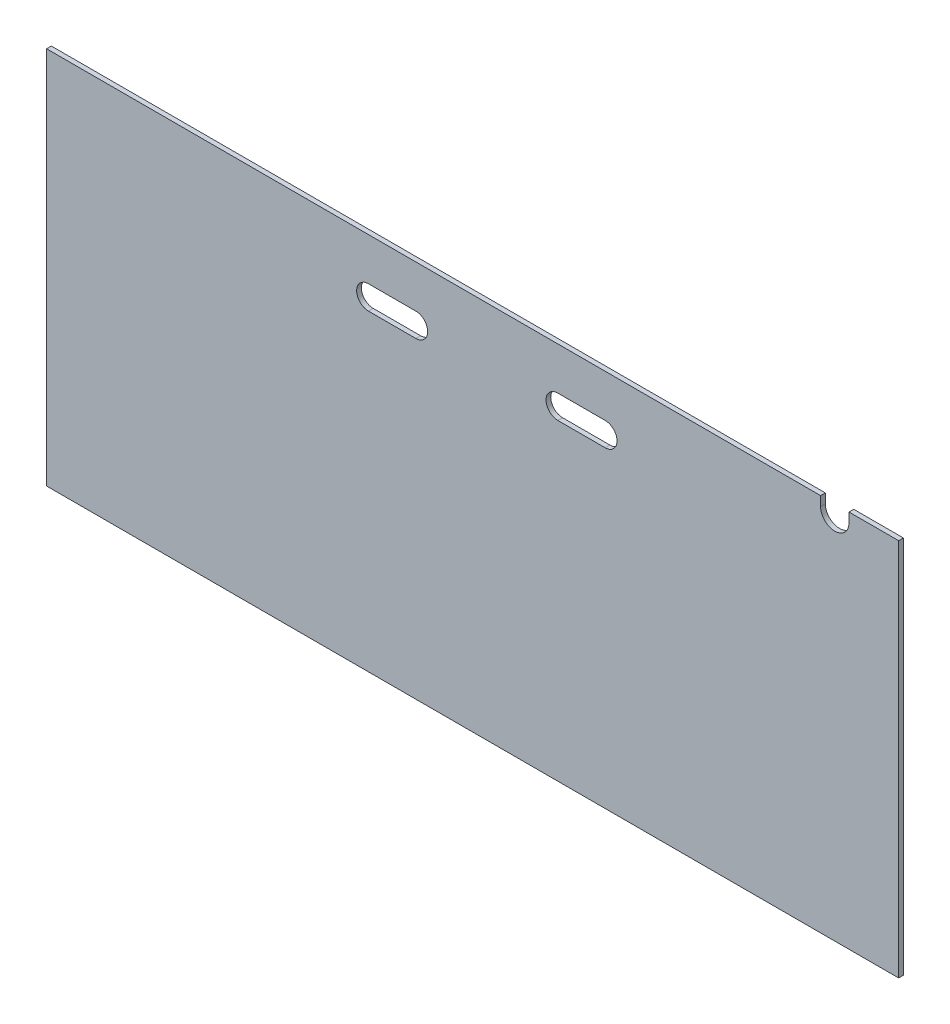
ISO-10303-21;
HEADER;
FILE_DESCRIPTION(('STEP AP214'),'2;1');
FILE_NAME('part.step','',(''),(''),'','','');
FILE_SCHEMA(('AUTOMOTIVE_DESIGN { 1 0 10303 214 1 1 1 1 }'));
ENDSEC;
DATA;
#1=APPLICATION_CONTEXT('core data for automotive mechanical design processes');
#2=APPLICATION_PROTOCOL_DEFINITION('international standard','automotive_design',2000,#1);
#3=PRODUCT_CONTEXT('',#1,'mechanical');
#4=PRODUCT('Part','Part','',(#3));
#5=PRODUCT_RELATED_PRODUCT_CATEGORY('part','',(#4));
#6=PRODUCT_DEFINITION_FORMATION('','',#4);
#7=PRODUCT_DEFINITION_CONTEXT('part definition',#1,'design');
#8=PRODUCT_DEFINITION('design','',#6,#7);
#9=PRODUCT_DEFINITION_SHAPE('','',#8);
#10=(LENGTH_UNIT() NAMED_UNIT(*) SI_UNIT(.MILLI.,.METRE.));
#11=(NAMED_UNIT(*) PLANE_ANGLE_UNIT() SI_UNIT($,.RADIAN.));
#12=(NAMED_UNIT(*) SI_UNIT($,.STERADIAN.) SOLID_ANGLE_UNIT());
#13=UNCERTAINTY_MEASURE_WITH_UNIT(LENGTH_MEASURE(1.E-05),#10,'distance_accuracy_value','');
#14=(GEOMETRIC_REPRESENTATION_CONTEXT(3) GLOBAL_UNCERTAINTY_ASSIGNED_CONTEXT((#13)) GLOBAL_UNIT_ASSIGNED_CONTEXT((#10,
#11,#12)) REPRESENTATION_CONTEXT('',''));
#15=CARTESIAN_POINT('',(0.,0.,0.));
#16=DIRECTION('',(0.,0.,1.));
#17=DIRECTION('',(1.,0.,0.));
#18=AXIS2_PLACEMENT_3D('',#15,#16,#17);
#19=CARTESIAN_POINT('',(0.,508.,6.35));
#20=DIRECTION('',(0.,-1.,0.));
#21=DIRECTION('',(0.,0.,-1.));
#22=AXIS2_PLACEMENT_3D('',#19,#20,#21);
#23=PLANE('',#22);
#24=DIRECTION('',(-1.,0.,0.));
#25=VECTOR('',#24,1.);
#26=CARTESIAN_POINT('',(0.,508.,6.35));
#27=LINE('',#26,#25);
#28=CARTESIAN_POINT('',(1038.225,508.,6.35));
#29=VERTEX_POINT('',#28);
#30=CARTESIAN_POINT('',(0.,508.,6.35));
#31=VERTEX_POINT('',#30);
#32=EDGE_CURVE('E253',#29,#31,#27,.T.);
#33=ORIENTED_EDGE('',*,*,#32,.F.);
#34=DIRECTION('',(0.,0.,1.));
#35=VECTOR('',#34,1.);
#36=CARTESIAN_POINT('',(1038.225,508.,0.));
#37=LINE('',#36,#35);
#38=CARTESIAN_POINT('',(1038.225,508.,0.));
#39=VERTEX_POINT('',#38);
#40=EDGE_CURVE('E176',#39,#29,#37,.T.);
#41=ORIENTED_EDGE('',*,*,#40,.F.);
#42=DIRECTION('',(-1.,0.,0.));
#43=VECTOR('',#42,1.);
#44=CARTESIAN_POINT('',(0.,508.,0.));
#45=LINE('',#44,#43);
#46=CARTESIAN_POINT('',(0.,508.,0.));
#47=VERTEX_POINT('',#46);
#48=EDGE_CURVE('E167',#39,#47,#45,.T.);
#49=ORIENTED_EDGE('',*,*,#48,.T.);
#50=DIRECTION('',(0.,0.,-1.));
#51=VECTOR('',#50,1.);
#52=CARTESIAN_POINT('',(0.,508.,6.35));
#53=LINE('',#52,#51);
#54=EDGE_CURVE('E257',#31,#47,#53,.T.);
#55=ORIENTED_EDGE('',*,*,#54,.F.);
#56=EDGE_LOOP('',(#33,#41,#49,#55));
#57=FACE_BOUND('',#56,.T.);
#58=ADVANCED_FACE('F33',(#57),#23,.F.);
#59=CARTESIAN_POINT('',(0.,0.,6.35));
#60=DIRECTION('',(1.,0.,0.));
#61=DIRECTION('',(0.,0.,-1.));
#62=AXIS2_PLACEMENT_3D('',#59,#60,#61);
#63=PLANE('',#62);
#64=DIRECTION('',(0.,-1.,0.));
#65=VECTOR('',#64,1.);
#66=CARTESIAN_POINT('',(0.,0.,0.));
#67=LINE('',#66,#65);
#68=CARTESIAN_POINT('',(0.,0.,0.));
#69=VERTEX_POINT('',#68);
#70=EDGE_CURVE('E209',#47,#69,#67,.T.);
#71=ORIENTED_EDGE('',*,*,#70,.T.);
#72=DIRECTION('',(0.,0.,-1.));
#73=VECTOR('',#72,1.);
#74=CARTESIAN_POINT('',(0.,0.,6.35));
#75=LINE('',#74,#73);
#76=CARTESIAN_POINT('',(0.,0.,6.35));
#77=VERTEX_POINT('',#76);
#78=EDGE_CURVE('E11',#77,#69,#75,.T.);
#79=ORIENTED_EDGE('',*,*,#78,.F.);
#80=DIRECTION('',(0.,-1.,0.));
#81=VECTOR('',#80,1.);
#82=CARTESIAN_POINT('',(0.,0.,6.35));
#83=LINE('',#82,#81);
#84=EDGE_CURVE('E245',#31,#77,#83,.T.);
#85=ORIENTED_EDGE('',*,*,#84,.F.);
#86=ORIENTED_EDGE('',*,*,#54,.T.);
#87=EDGE_LOOP('',(#71,#79,#85,#86));
#88=FACE_BOUND('',#87,.T.);
#89=ADVANCED_FACE('F35',(#88),#63,.F.);
#90=CARTESIAN_POINT('',(0.,0.,6.35));
#91=DIRECTION('',(0.,1.,0.));
#92=DIRECTION('',(0.,0.,1.));
#93=AXIS2_PLACEMENT_3D('',#90,#91,#92);
#94=PLANE('',#93);
#95=DIRECTION('',(1.,0.,0.));
#96=VECTOR('',#95,1.);
#97=CARTESIAN_POINT('',(0.,0.,0.));
#98=LINE('',#97,#96);
#99=CARTESIAN_POINT('',(1143.,0.,0.));
#100=VERTEX_POINT('',#99);
#101=EDGE_CURVE('E260',#69,#100,#98,.T.);
#102=ORIENTED_EDGE('',*,*,#101,.T.);
#103=DIRECTION('',(0.,0.,-1.));
#104=VECTOR('',#103,1.);
#105=CARTESIAN_POINT('',(1143.,0.,6.35));
#106=LINE('',#105,#104);
#107=CARTESIAN_POINT('',(1143.,0.,6.35));
#108=VERTEX_POINT('',#107);
#109=EDGE_CURVE('E41',#108,#100,#106,.T.);
#110=ORIENTED_EDGE('',*,*,#109,.F.);
#111=DIRECTION('',(1.,0.,0.));
#112=VECTOR('',#111,1.);
#113=CARTESIAN_POINT('',(0.,0.,6.35));
#114=LINE('',#113,#112);
#115=EDGE_CURVE('E248',#77,#108,#114,.T.);
#116=ORIENTED_EDGE('',*,*,#115,.F.);
#117=ORIENTED_EDGE('',*,*,#78,.T.);
#118=EDGE_LOOP('',(#102,#110,#116,#117));
#119=FACE_BOUND('',#118,.T.);
#120=ADVANCED_FACE('F287',(#119),#94,.F.);
#121=CARTESIAN_POINT('',(1143.,0.,6.35));
#122=DIRECTION('',(-1.,0.,0.));
#123=DIRECTION('',(0.,0.,1.));
#124=AXIS2_PLACEMENT_3D('',#121,#122,#123);
#125=PLANE('',#124);
#126=DIRECTION('',(0.,1.,0.));
#127=VECTOR('',#126,1.);
#128=CARTESIAN_POINT('',(1143.,0.,0.));
#129=LINE('',#128,#127);
#130=CARTESIAN_POINT('',(1143.,508.,0.));
#131=VERTEX_POINT('',#130);
#132=EDGE_CURVE('E262',#100,#131,#129,.T.);
#133=ORIENTED_EDGE('',*,*,#132,.T.);
#134=DIRECTION('',(0.,0.,-1.));
#135=VECTOR('',#134,1.);
#136=CARTESIAN_POINT('',(1143.,508.,6.35));
#137=LINE('',#136,#135);
#138=CARTESIAN_POINT('',(1143.,508.,6.35));
#139=VERTEX_POINT('',#138);
#140=EDGE_CURVE('E268',#139,#131,#137,.T.);
#141=ORIENTED_EDGE('',*,*,#140,.F.);
#142=DIRECTION('',(0.,1.,0.));
#143=VECTOR('',#142,1.);
#144=CARTESIAN_POINT('',(1143.,0.,6.35));
#145=LINE('',#144,#143);
#146=EDGE_CURVE('E251',#108,#139,#145,.T.);
#147=ORIENTED_EDGE('',*,*,#146,.F.);
#148=ORIENTED_EDGE('',*,*,#109,.T.);
#149=EDGE_LOOP('',(#133,#141,#147,#148));
#150=FACE_BOUND('',#149,.T.);
#151=ADVANCED_FACE('F275',(#150),#125,.F.);
#152=CARTESIAN_POINT('',(1076.325,508.,0.));
#153=VERTEX_POINT('',#152);
#154=EDGE_CURVE('E249',#131,#153,#45,.T.);
#155=ORIENTED_EDGE('',*,*,#154,.T.);
#156=DIRECTION('',(0.,0.,1.));
#157=VECTOR('',#156,1.);
#158=CARTESIAN_POINT('',(1076.325,508.,0.));
#159=LINE('',#158,#157);
#160=CARTESIAN_POINT('',(1076.325,508.,6.35));
#161=VERTEX_POINT('',#160);
#162=EDGE_CURVE('E179',#153,#161,#159,.T.);
#163=ORIENTED_EDGE('',*,*,#162,.T.);
#164=EDGE_CURVE('E254',#139,#161,#27,.T.);
#165=ORIENTED_EDGE('',*,*,#164,.F.);
#166=ORIENTED_EDGE('',*,*,#140,.T.);
#167=EDGE_LOOP('',(#155,#163,#165,#166));
#168=FACE_BOUND('',#167,.T.);
#169=ADVANCED_FACE('F280',(#168),#23,.F.);
#170=CARTESIAN_POINT('',(0.,0.,6.35));
#171=DIRECTION('',(0.,0.,-1.));
#172=DIRECTION('',(-1.,0.,0.));
#173=AXIS2_PLACEMENT_3D('',#170,#171,#172);
#174=PLANE('',#173);
#175=DIRECTION('',(1.,0.,0.));
#176=VECTOR('',#175,1.);
#177=CARTESIAN_POINT('',(431.8,419.1,6.35));
#178=LINE('',#177,#176);
#179=CARTESIAN_POINT('',(431.8,419.1,6.35));
#180=VERTEX_POINT('',#179);
#181=CARTESIAN_POINT('',(495.3,419.1,6.35));
#182=VERTEX_POINT('',#181);
#183=EDGE_CURVE('E198',#180,#182,#178,.T.);
#184=ORIENTED_EDGE('',*,*,#183,.F.);
#185=CARTESIAN_POINT('',(431.8,434.975,6.35));
#186=DIRECTION('',(0.,0.,1.));
#187=DIRECTION('',(1.,0.,0.));
#188=AXIS2_PLACEMENT_3D('',#185,#186,#187);
#189=CIRCLE('',#188,15.875);
#190=CARTESIAN_POINT('',(431.8,450.85,6.35));
#191=VERTEX_POINT('',#190);
#192=EDGE_CURVE('E56',#191,#180,#189,.T.);
#193=ORIENTED_EDGE('',*,*,#192,.F.);
#194=DIRECTION('',(-1.,0.,0.));
#195=VECTOR('',#194,1.);
#196=CARTESIAN_POINT('',(431.8,450.85,6.35));
#197=LINE('',#196,#195);
#198=CARTESIAN_POINT('',(495.3,450.85,6.35));
#199=VERTEX_POINT('',#198);
#200=EDGE_CURVE('E187',#199,#191,#197,.T.);
#201=ORIENTED_EDGE('',*,*,#200,.F.);
#202=CARTESIAN_POINT('',(495.3,434.975,6.35));
#203=DIRECTION('',(0.,0.,1.));
#204=DIRECTION('',(1.,0.,0.));
#205=AXIS2_PLACEMENT_3D('',#202,#203,#204);
#206=CIRCLE('',#205,15.875);
#207=EDGE_CURVE('E202',#182,#199,#206,.T.);
#208=ORIENTED_EDGE('',*,*,#207,.F.);
#209=EDGE_LOOP('',(#184,#193,#201,#208));
#210=FACE_BOUND('',#209,.T.);
#211=DIRECTION('',(1.,0.,0.));
#212=VECTOR('',#211,1.);
#213=CARTESIAN_POINT('',(685.8,419.1,6.35));
#214=LINE('',#213,#212);
#215=CARTESIAN_POINT('',(685.8,419.1,6.35));
#216=VERTEX_POINT('',#215);
#217=CARTESIAN_POINT('',(749.3,419.1,6.35));
#218=VERTEX_POINT('',#217);
#219=EDGE_CURVE('E230',#216,#218,#214,.T.);
#220=ORIENTED_EDGE('',*,*,#219,.F.);
#221=CARTESIAN_POINT('',(685.8,434.975,6.35));
#222=DIRECTION('',(0.,0.,1.));
#223=DIRECTION('',(1.,0.,0.));
#224=AXIS2_PLACEMENT_3D('',#221,#222,#223);
#225=CIRCLE('',#224,15.875);
#226=CARTESIAN_POINT('',(685.8,450.85,6.35));
#227=VERTEX_POINT('',#226);
#228=EDGE_CURVE('E178',#227,#216,#225,.T.);
#229=ORIENTED_EDGE('',*,*,#228,.F.);
#230=DIRECTION('',(-1.,0.,0.));
#231=VECTOR('',#230,1.);
#232=CARTESIAN_POINT('',(685.8,450.85,6.35));
#233=LINE('',#232,#231);
#234=CARTESIAN_POINT('',(749.3,450.85,6.35));
#235=VERTEX_POINT('',#234);
#236=EDGE_CURVE('E219',#235,#227,#233,.T.);
#237=ORIENTED_EDGE('',*,*,#236,.F.);
#238=CARTESIAN_POINT('',(749.3,434.975,6.35));
#239=DIRECTION('',(0.,0.,1.));
#240=DIRECTION('',(1.,0.,0.));
#241=AXIS2_PLACEMENT_3D('',#238,#239,#240);
#242=CIRCLE('',#241,15.875);
#243=EDGE_CURVE('E233',#218,#235,#242,.T.);
#244=ORIENTED_EDGE('',*,*,#243,.F.);
#245=EDGE_LOOP('',(#220,#229,#237,#244));
#246=FACE_BOUND('',#245,.T.);
#247=CARTESIAN_POINT('',(1057.275,495.3,6.35));
#248=DIRECTION('',(0.,0.,1.));
#249=DIRECTION('',(-1.,0.,0.));
#250=AXIS2_PLACEMENT_3D('',#247,#248,#249);
#251=CIRCLE('',#250,19.05);
#252=CARTESIAN_POINT('',(1038.225,495.3,6.35));
#253=VERTEX_POINT('',#252);
#254=CARTESIAN_POINT('',(1076.325,495.3,6.35));
#255=VERTEX_POINT('',#254);
#256=EDGE_CURVE('E170',#253,#255,#251,.T.);
#257=ORIENTED_EDGE('',*,*,#256,.F.);
#258=DIRECTION('',(0.,-1.,0.));
#259=VECTOR('',#258,1.);
#260=CARTESIAN_POINT('',(1038.225,508.,6.35));
#261=LINE('',#260,#259);
#262=EDGE_CURVE('E152',#29,#253,#261,.T.);
#263=ORIENTED_EDGE('',*,*,#262,.F.);
#264=ORIENTED_EDGE('',*,*,#32,.T.);
#265=ORIENTED_EDGE('',*,*,#84,.T.);
#266=ORIENTED_EDGE('',*,*,#115,.T.);
#267=ORIENTED_EDGE('',*,*,#146,.T.);
#268=ORIENTED_EDGE('',*,*,#164,.T.);
#269=DIRECTION('',(0.,1.,0.));
#270=VECTOR('',#269,1.);
#271=CARTESIAN_POINT('',(1076.325,508.,6.35));
#272=LINE('',#271,#270);
#273=EDGE_CURVE('E168',#255,#161,#272,.T.);
#274=ORIENTED_EDGE('',*,*,#273,.F.);
#275=EDGE_LOOP('',(#257,#263,#264,#265,#266,#267,#268,#274));
#276=FACE_BOUND('',#275,.T.);
#277=ADVANCED_FACE('F284',(#210,#246,#276),#174,.F.);
#278=CARTESIAN_POINT('',(0.,0.,0.));
#279=DIRECTION('',(0.,0.,-1.));
#280=DIRECTION('',(-1.,0.,0.));
#281=AXIS2_PLACEMENT_3D('',#278,#279,#280);
#282=PLANE('',#281);
#283=DIRECTION('',(0.,-1.,0.));
#284=VECTOR('',#283,1.);
#285=CARTESIAN_POINT('',(1038.225,508.,0.));
#286=LINE('',#285,#284);
#287=CARTESIAN_POINT('',(1038.225,495.3,0.));
#288=VERTEX_POINT('',#287);
#289=EDGE_CURVE('E149',#39,#288,#286,.T.);
#290=ORIENTED_EDGE('',*,*,#289,.T.);
#291=CARTESIAN_POINT('',(1057.275,495.3,0.));
#292=DIRECTION('',(0.,0.,1.));
#293=DIRECTION('',(-1.,0.,0.));
#294=AXIS2_PLACEMENT_3D('',#291,#292,#293);
#295=CIRCLE('',#294,19.05);
#296=CARTESIAN_POINT('',(1076.325,495.3,0.));
#297=VERTEX_POINT('',#296);
#298=EDGE_CURVE('E159',#288,#297,#295,.T.);
#299=ORIENTED_EDGE('',*,*,#298,.T.);
#300=DIRECTION('',(0.,1.,0.));
#301=VECTOR('',#300,1.);
#302=CARTESIAN_POINT('',(1076.325,508.,0.));
#303=LINE('',#302,#301);
#304=EDGE_CURVE('E48',#297,#153,#303,.T.);
#305=ORIENTED_EDGE('',*,*,#304,.T.);
#306=ORIENTED_EDGE('',*,*,#154,.F.);
#307=ORIENTED_EDGE('',*,*,#132,.F.);
#308=ORIENTED_EDGE('',*,*,#101,.F.);
#309=ORIENTED_EDGE('',*,*,#70,.F.);
#310=ORIENTED_EDGE('',*,*,#48,.F.);
#311=EDGE_LOOP('',(#290,#299,#305,#306,#307,#308,#309,#310));
#312=FACE_BOUND('',#311,.T.);
#313=CARTESIAN_POINT('',(431.8,434.975,0.));
#314=DIRECTION('',(0.,0.,1.));
#315=DIRECTION('',(1.,0.,0.));
#316=AXIS2_PLACEMENT_3D('',#313,#314,#315);
#317=CIRCLE('',#316,15.875);
#318=CARTESIAN_POINT('',(431.8,450.85,0.));
#319=VERTEX_POINT('',#318);
#320=CARTESIAN_POINT('',(431.8,419.1,0.));
#321=VERTEX_POINT('',#320);
#322=EDGE_CURVE('E183',#319,#321,#317,.T.);
#323=ORIENTED_EDGE('',*,*,#322,.T.);
#324=DIRECTION('',(1.,0.,0.));
#325=VECTOR('',#324,1.);
#326=CARTESIAN_POINT('',(431.8,419.1,0.));
#327=LINE('',#326,#325);
#328=CARTESIAN_POINT('',(495.3,419.1,0.));
#329=VERTEX_POINT('',#328);
#330=EDGE_CURVE('E186',#321,#329,#327,.T.);
#331=ORIENTED_EDGE('',*,*,#330,.T.);
#332=CARTESIAN_POINT('',(495.3,434.975,0.));
#333=DIRECTION('',(0.,0.,1.));
#334=DIRECTION('',(1.,0.,0.));
#335=AXIS2_PLACEMENT_3D('',#332,#333,#334);
#336=CIRCLE('',#335,15.875);
#337=CARTESIAN_POINT('',(495.3,450.85,0.));
#338=VERTEX_POINT('',#337);
#339=EDGE_CURVE('E190',#329,#338,#336,.T.);
#340=ORIENTED_EDGE('',*,*,#339,.T.);
#341=DIRECTION('',(-1.,0.,0.));
#342=VECTOR('',#341,1.);
#343=CARTESIAN_POINT('',(431.8,450.85,0.));
#344=LINE('',#343,#342);
#345=EDGE_CURVE('E193',#338,#319,#344,.T.);
#346=ORIENTED_EDGE('',*,*,#345,.T.);
#347=EDGE_LOOP('',(#323,#331,#340,#346));
#348=FACE_BOUND('',#347,.T.);
#349=CARTESIAN_POINT('',(685.8,434.975,0.));
#350=DIRECTION('',(0.,0.,1.));
#351=DIRECTION('',(1.,0.,0.));
#352=AXIS2_PLACEMENT_3D('',#349,#350,#351);
#353=CIRCLE('',#352,15.875);
#354=CARTESIAN_POINT('',(685.8,450.85,0.));
#355=VERTEX_POINT('',#354);
#356=CARTESIAN_POINT('',(685.8,419.1,0.));
#357=VERTEX_POINT('',#356);
#358=EDGE_CURVE('E215',#355,#357,#353,.T.);
#359=ORIENTED_EDGE('',*,*,#358,.T.);
#360=DIRECTION('',(1.,0.,0.));
#361=VECTOR('',#360,1.);
#362=CARTESIAN_POINT('',(685.8,419.1,0.));
#363=LINE('',#362,#361);
#364=CARTESIAN_POINT('',(749.3,419.1,0.));
#365=VERTEX_POINT('',#364);
#366=EDGE_CURVE('E218',#357,#365,#363,.T.);
#367=ORIENTED_EDGE('',*,*,#366,.T.);
#368=CARTESIAN_POINT('',(749.3,434.975,0.));
#369=DIRECTION('',(0.,0.,1.));
#370=DIRECTION('',(1.,0.,0.));
#371=AXIS2_PLACEMENT_3D('',#368,#369,#370);
#372=CIRCLE('',#371,15.875);
#373=CARTESIAN_POINT('',(749.3,450.85,0.));
#374=VERTEX_POINT('',#373);
#375=EDGE_CURVE('E222',#365,#374,#372,.T.);
#376=ORIENTED_EDGE('',*,*,#375,.T.);
#377=DIRECTION('',(-1.,0.,0.));
#378=VECTOR('',#377,1.);
#379=CARTESIAN_POINT('',(685.8,450.85,0.));
#380=LINE('',#379,#378);
#381=EDGE_CURVE('E225',#374,#355,#380,.T.);
#382=ORIENTED_EDGE('',*,*,#381,.T.);
#383=EDGE_LOOP('',(#359,#367,#376,#382));
#384=FACE_BOUND('',#383,.T.);
#385=ADVANCED_FACE('F164',(#312,#348,#384),#282,.T.);
#386=CARTESIAN_POINT('',(685.8,434.975,0.));
#387=DIRECTION('',(0.,0.,1.));
#388=DIRECTION('',(1.,0.,0.));
#389=AXIS2_PLACEMENT_3D('',#386,#387,#388);
#390=CYLINDRICAL_SURFACE('',#389,15.875);
#391=ORIENTED_EDGE('',*,*,#228,.T.);
#392=DIRECTION('',(0.,0.,1.));
#393=VECTOR('',#392,1.);
#394=CARTESIAN_POINT('',(685.8,419.1,0.));
#395=LINE('',#394,#393);
#396=EDGE_CURVE('E228',#357,#216,#395,.T.);
#397=ORIENTED_EDGE('',*,*,#396,.F.);
#398=ORIENTED_EDGE('',*,*,#358,.F.);
#399=DIRECTION('',(0.,0.,1.));
#400=VECTOR('',#399,1.);
#401=CARTESIAN_POINT('',(685.8,450.85,0.));
#402=LINE('',#401,#400);
#403=EDGE_CURVE('E199',#355,#227,#402,.T.);
#404=ORIENTED_EDGE('',*,*,#403,.T.);
#405=EDGE_LOOP('',(#391,#397,#398,#404));
#406=FACE_BOUND('',#405,.T.);
#407=ADVANCED_FACE('F341',(#406),#390,.F.);
#408=CARTESIAN_POINT('',(685.8,450.85,0.));
#409=DIRECTION('',(0.,1.,0.));
#410=DIRECTION('',(0.,0.,1.));
#411=AXIS2_PLACEMENT_3D('',#408,#409,#410);
#412=PLANE('',#411);
#413=ORIENTED_EDGE('',*,*,#236,.T.);
#414=ORIENTED_EDGE('',*,*,#403,.F.);
#415=ORIENTED_EDGE('',*,*,#381,.F.);
#416=DIRECTION('',(0.,0.,1.));
#417=VECTOR('',#416,1.);
#418=CARTESIAN_POINT('',(749.3,450.85,0.));
#419=LINE('',#418,#417);
#420=EDGE_CURVE('E239',#374,#235,#419,.T.);
#421=ORIENTED_EDGE('',*,*,#420,.T.);
#422=EDGE_LOOP('',(#413,#414,#415,#421));
#423=FACE_BOUND('',#422,.T.);
#424=ADVANCED_FACE('F348',(#423),#412,.F.);
#425=CARTESIAN_POINT('',(749.3,434.975,0.));
#426=DIRECTION('',(0.,0.,1.));
#427=DIRECTION('',(1.,0.,0.));
#428=AXIS2_PLACEMENT_3D('',#425,#426,#427);
#429=CYLINDRICAL_SURFACE('',#428,15.875);
#430=ORIENTED_EDGE('',*,*,#243,.T.);
#431=ORIENTED_EDGE('',*,*,#420,.F.);
#432=ORIENTED_EDGE('',*,*,#375,.F.);
#433=DIRECTION('',(0.,0.,1.));
#434=VECTOR('',#433,1.);
#435=CARTESIAN_POINT('',(749.3,419.1,0.));
#436=LINE('',#435,#434);
#437=EDGE_CURVE('E241',#365,#218,#436,.T.);
#438=ORIENTED_EDGE('',*,*,#437,.T.);
#439=EDGE_LOOP('',(#430,#431,#432,#438));
#440=FACE_BOUND('',#439,.T.);
#441=ADVANCED_FACE('F357',(#440),#429,.F.);
#442=CARTESIAN_POINT('',(685.8,419.1,0.));
#443=DIRECTION('',(0.,-1.,0.));
#444=DIRECTION('',(0.,0.,-1.));
#445=AXIS2_PLACEMENT_3D('',#442,#443,#444);
#446=PLANE('',#445);
#447=ORIENTED_EDGE('',*,*,#219,.T.);
#448=ORIENTED_EDGE('',*,*,#437,.F.);
#449=ORIENTED_EDGE('',*,*,#366,.F.);
#450=ORIENTED_EDGE('',*,*,#396,.T.);
#451=EDGE_LOOP('',(#447,#448,#449,#450));
#452=FACE_BOUND('',#451,.T.);
#453=ADVANCED_FACE('F366',(#452),#446,.F.);
#454=CARTESIAN_POINT('',(431.8,434.975,0.));
#455=DIRECTION('',(0.,0.,1.));
#456=DIRECTION('',(1.,0.,0.));
#457=AXIS2_PLACEMENT_3D('',#454,#455,#456);
#458=CYLINDRICAL_SURFACE('',#457,15.875);
#459=ORIENTED_EDGE('',*,*,#192,.T.);
#460=DIRECTION('',(0.,0.,1.));
#461=VECTOR('',#460,1.);
#462=CARTESIAN_POINT('',(431.8,419.1,0.));
#463=LINE('',#462,#461);
#464=EDGE_CURVE('E196',#321,#180,#463,.T.);
#465=ORIENTED_EDGE('',*,*,#464,.F.);
#466=ORIENTED_EDGE('',*,*,#322,.F.);
#467=DIRECTION('',(0.,0.,1.));
#468=VECTOR('',#467,1.);
#469=CARTESIAN_POINT('',(431.8,450.85,0.));
#470=LINE('',#469,#468);
#471=EDGE_CURVE('E207',#319,#191,#470,.T.);
#472=ORIENTED_EDGE('',*,*,#471,.T.);
#473=EDGE_LOOP('',(#459,#465,#466,#472));
#474=FACE_BOUND('',#473,.T.);
#475=ADVANCED_FACE('F375',(#474),#458,.F.);
#476=CARTESIAN_POINT('',(431.8,450.85,0.));
#477=DIRECTION('',(0.,1.,0.));
#478=DIRECTION('',(0.,0.,1.));
#479=AXIS2_PLACEMENT_3D('',#476,#477,#478);
#480=PLANE('',#479);
#481=ORIENTED_EDGE('',*,*,#200,.T.);
#482=ORIENTED_EDGE('',*,*,#471,.F.);
#483=ORIENTED_EDGE('',*,*,#345,.F.);
#484=DIRECTION('',(0.,0.,1.));
#485=VECTOR('',#484,1.);
#486=CARTESIAN_POINT('',(495.3,450.85,0.));
#487=LINE('',#486,#485);
#488=EDGE_CURVE('E210',#338,#199,#487,.T.);
#489=ORIENTED_EDGE('',*,*,#488,.T.);
#490=EDGE_LOOP('',(#481,#482,#483,#489));
#491=FACE_BOUND('',#490,.T.);
#492=ADVANCED_FACE('F384',(#491),#480,.F.);
#493=CARTESIAN_POINT('',(495.3,434.975,0.));
#494=DIRECTION('',(0.,0.,1.));
#495=DIRECTION('',(1.,0.,0.));
#496=AXIS2_PLACEMENT_3D('',#493,#494,#495);
#497=CYLINDRICAL_SURFACE('',#496,15.875);
#498=ORIENTED_EDGE('',*,*,#207,.T.);
#499=ORIENTED_EDGE('',*,*,#488,.F.);
#500=ORIENTED_EDGE('',*,*,#339,.F.);
#501=DIRECTION('',(0.,0.,1.));
#502=VECTOR('',#501,1.);
#503=CARTESIAN_POINT('',(495.3,419.1,0.));
#504=LINE('',#503,#502);
#505=EDGE_CURVE('E212',#329,#182,#504,.T.);
#506=ORIENTED_EDGE('',*,*,#505,.T.);
#507=EDGE_LOOP('',(#498,#499,#500,#506));
#508=FACE_BOUND('',#507,.T.);
#509=ADVANCED_FACE('F392',(#508),#497,.F.);
#510=CARTESIAN_POINT('',(431.8,419.1,0.));
#511=DIRECTION('',(0.,-1.,0.));
#512=DIRECTION('',(0.,0.,-1.));
#513=AXIS2_PLACEMENT_3D('',#510,#511,#512);
#514=PLANE('',#513);
#515=ORIENTED_EDGE('',*,*,#183,.T.);
#516=ORIENTED_EDGE('',*,*,#505,.F.);
#517=ORIENTED_EDGE('',*,*,#330,.F.);
#518=ORIENTED_EDGE('',*,*,#464,.T.);
#519=EDGE_LOOP('',(#515,#516,#517,#518));
#520=FACE_BOUND('',#519,.T.);
#521=ADVANCED_FACE('F401',(#520),#514,.F.);
#522=CARTESIAN_POINT('',(1038.225,508.,0.));
#523=DIRECTION('',(-1.,0.,0.));
#524=DIRECTION('',(0.,0.,1.));
#525=AXIS2_PLACEMENT_3D('',#522,#523,#524);
#526=PLANE('',#525);
#527=ORIENTED_EDGE('',*,*,#262,.T.);
#528=DIRECTION('',(0.,0.,1.));
#529=VECTOR('',#528,1.);
#530=CARTESIAN_POINT('',(1038.225,495.3,0.));
#531=LINE('',#530,#529);
#532=EDGE_CURVE('E145',#288,#253,#531,.T.);
#533=ORIENTED_EDGE('',*,*,#532,.F.);
#534=ORIENTED_EDGE('',*,*,#289,.F.);
#535=ORIENTED_EDGE('',*,*,#40,.T.);
#536=EDGE_LOOP('',(#527,#533,#534,#535));
#537=FACE_BOUND('',#536,.T.);
#538=ADVANCED_FACE('F147',(#537),#526,.F.);
#539=CARTESIAN_POINT('',(1076.325,508.,0.));
#540=DIRECTION('',(1.,0.,0.));
#541=DIRECTION('',(0.,0.,-1.));
#542=AXIS2_PLACEMENT_3D('',#539,#540,#541);
#543=PLANE('',#542);
#544=ORIENTED_EDGE('',*,*,#273,.T.);
#545=ORIENTED_EDGE('',*,*,#162,.F.);
#546=ORIENTED_EDGE('',*,*,#304,.F.);
#547=DIRECTION('',(0.,0.,1.));
#548=VECTOR('',#547,1.);
#549=CARTESIAN_POINT('',(1076.325,495.3,0.));
#550=LINE('',#549,#548);
#551=EDGE_CURVE('E156',#297,#255,#550,.T.);
#552=ORIENTED_EDGE('',*,*,#551,.T.);
#553=EDGE_LOOP('',(#544,#545,#546,#552));
#554=FACE_BOUND('',#553,.T.);
#555=ADVANCED_FACE('F421',(#554),#543,.F.);
#556=CARTESIAN_POINT('',(1057.275,495.3,0.));
#557=DIRECTION('',(0.,0.,1.));
#558=DIRECTION('',(1.,0.,0.));
#559=AXIS2_PLACEMENT_3D('',#556,#557,#558);
#560=CYLINDRICAL_SURFACE('',#559,19.05);
#561=ORIENTED_EDGE('',*,*,#256,.T.);
#562=ORIENTED_EDGE('',*,*,#551,.F.);
#563=ORIENTED_EDGE('',*,*,#298,.F.);
#564=ORIENTED_EDGE('',*,*,#532,.T.);
#565=EDGE_LOOP('',(#561,#562,#563,#564));
#566=FACE_BOUND('',#565,.T.);
#567=ADVANCED_FACE('F160',(#566),#560,.F.);
#568=CLOSED_SHELL('',(#58,#89,#120,#151,#169,#277,#385,#407,#424,#441,#453,#475,#492,#509,#521,
#538,#555,#567));
#569=MANIFOLD_SOLID_BREP('B2',#568);
#570=ADVANCED_BREP_SHAPE_REPRESENTATION('',(#18,#569),#14);
#571=SHAPE_DEFINITION_REPRESENTATION(#9,#570);
ENDSEC;
END-ISO-10303-21;
